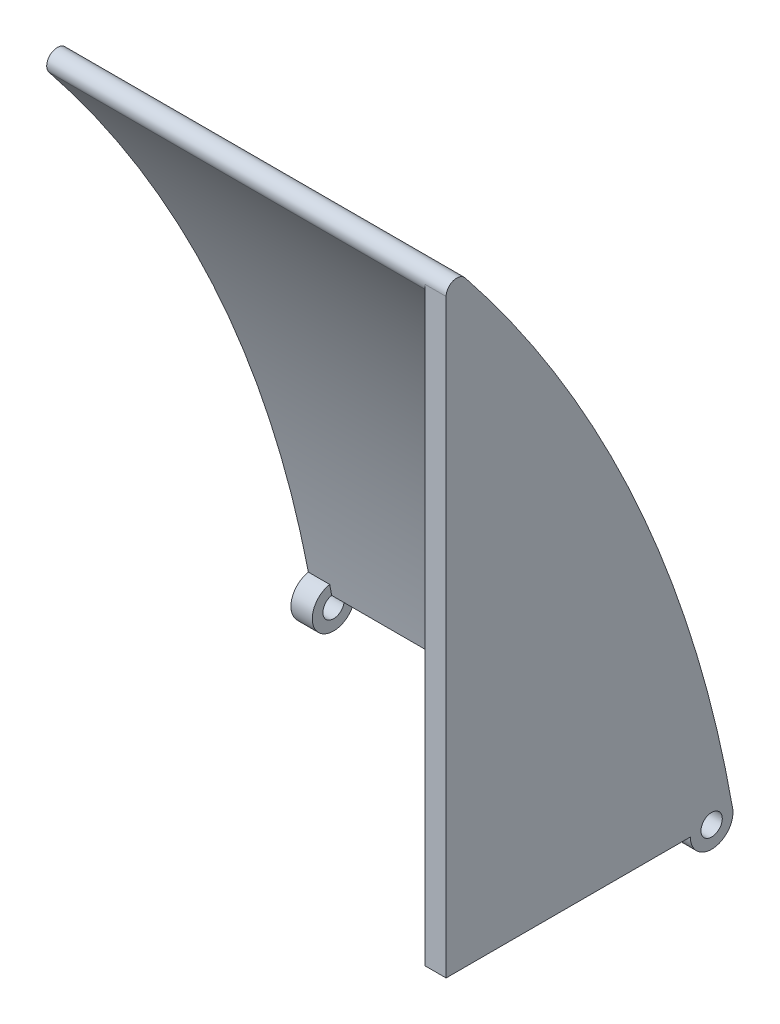
ISO-10303-21;
HEADER;
FILE_DESCRIPTION(('STEP AP214'),'2;1');
FILE_NAME('part.step','',(''),(''),'','','');
FILE_SCHEMA(('AUTOMOTIVE_DESIGN { 1 0 10303 214 1 1 1 1 }'));
ENDSEC;
DATA;
#1=APPLICATION_CONTEXT('core data for automotive mechanical design processes');
#2=APPLICATION_PROTOCOL_DEFINITION('international standard','automotive_design',2000,#1);
#3=PRODUCT_CONTEXT('',#1,'mechanical');
#4=PRODUCT('Part','Part','',(#3));
#5=PRODUCT_RELATED_PRODUCT_CATEGORY('part','',(#4));
#6=PRODUCT_DEFINITION_FORMATION('','',#4);
#7=PRODUCT_DEFINITION_CONTEXT('part definition',#1,'design');
#8=PRODUCT_DEFINITION('design','',#6,#7);
#9=PRODUCT_DEFINITION_SHAPE('','',#8);
#10=(LENGTH_UNIT() NAMED_UNIT(*) SI_UNIT(.MILLI.,.METRE.));
#11=(NAMED_UNIT(*) PLANE_ANGLE_UNIT() SI_UNIT($,.RADIAN.));
#12=(NAMED_UNIT(*) SI_UNIT($,.STERADIAN.) SOLID_ANGLE_UNIT());
#13=UNCERTAINTY_MEASURE_WITH_UNIT(LENGTH_MEASURE(1.E-05),#10,'distance_accuracy_value','');
#14=(GEOMETRIC_REPRESENTATION_CONTEXT(3) GLOBAL_UNCERTAINTY_ASSIGNED_CONTEXT((#13)) GLOBAL_UNIT_ASSIGNED_CONTEXT((#10,
#11,#12)) REPRESENTATION_CONTEXT('',''));
#15=CARTESIAN_POINT('',(0.,0.,0.));
#16=DIRECTION('',(0.,0.,1.));
#17=DIRECTION('',(1.,0.,0.));
#18=AXIS2_PLACEMENT_3D('',#15,#16,#17);
#19=CARTESIAN_POINT('',(46.84,-52.6701912273033,304.466268426335));
#20=DIRECTION('',(-1.,0.,0.));
#21=DIRECTION('',(0.,0.,1.));
#22=AXIS2_PLACEMENT_3D('',#19,#20,#21);
#23=CYLINDRICAL_SURFACE('',#22,303.986824400941);
#24=CARTESIAN_POINT('',(41.84,-52.6701912273033,304.466268426335));
#25=DIRECTION('',(1.,0.,0.));
#26=DIRECTION('',(0.,0.,-1.));
#27=AXIS2_PLACEMENT_3D('',#24,#25,#26);
#28=CIRCLE('',#27,303.986824400941);
#29=CARTESIAN_POINT('',(41.84,136.882226425013,66.8155365285973));
#30=VERTEX_POINT('',#29);
#31=CARTESIAN_POINT('',(41.84,2.46038215953579,5.52043840456218));
#32=VERTEX_POINT('',#31);
#33=EDGE_CURVE('E121',#30,#32,#28,.F.);
#34=ORIENTED_EDGE('',*,*,#33,.F.);
#35=DIRECTION('',(-1.,0.,0.));
#36=VECTOR('',#35,1.);
#37=CARTESIAN_POINT('',(46.84,136.882226425013,66.8155365285973));
#38=LINE('',#37,#36);
#39=CARTESIAN_POINT('',(-46.84,136.882226425013,66.8155365285973));
#40=VERTEX_POINT('',#39);
#41=EDGE_CURVE('E124',#30,#40,#38,.T.);
#42=ORIENTED_EDGE('',*,*,#41,.T.);
#43=CARTESIAN_POINT('',(-46.84,-52.6701912273033,304.466268426335));
#44=DIRECTION('',(-1.,0.,0.));
#45=DIRECTION('',(0.,0.,-1.));
#46=AXIS2_PLACEMENT_3D('',#43,#44,#45);
#47=CIRCLE('',#46,303.986824400941);
#48=CARTESIAN_POINT('',(-46.84,4.91708107240964,5.98394821549386));
#49=VERTEX_POINT('',#48);
#50=EDGE_CURVE('E156',#40,#49,#47,.T.);
#51=ORIENTED_EDGE('',*,*,#50,.T.);
#52=DIRECTION('',(-1.,0.,0.));
#53=VECTOR('',#52,1.);
#54=CARTESIAN_POINT('',(-44.34,4.91708107240862,5.98394821549367));
#55=LINE('',#54,#53);
#56=CARTESIAN_POINT('',(-41.84,4.91708107240861,5.98394821549372));
#57=VERTEX_POINT('',#56);
#58=EDGE_CURVE('E171',#57,#49,#55,.T.);
#59=ORIENTED_EDGE('',*,*,#58,.F.);
#60=CARTESIAN_POINT('',(-41.84,-52.6701912273033,304.466268426335));
#61=DIRECTION('',(-1.,0.,0.));
#62=DIRECTION('',(0.,0.,1.));
#63=AXIS2_PLACEMENT_3D('',#60,#61,#62);
#64=CIRCLE('',#63,303.986824400941);
#65=CARTESIAN_POINT('',(-41.84,2.460382159541,5.52043840456312));
#66=VERTEX_POINT('',#65);
#67=EDGE_CURVE('E41',#66,#57,#64,.F.);
#68=ORIENTED_EDGE('',*,*,#67,.F.);
#69=DIRECTION('',(1.,0.,0.));
#70=VECTOR('',#69,1.);
#71=CARTESIAN_POINT('',(0.,2.46038215953579,5.52043840456218));
#72=LINE('',#71,#70);
#73=EDGE_CURVE('E56',#66,#32,#72,.T.);
#74=ORIENTED_EDGE('',*,*,#73,.T.);
#75=EDGE_LOOP('',(#34,#42,#51,#59,#68,#74));
#76=FACE_BOUND('',#75,.T.);
#77=ADVANCED_FACE('F33',(#76),#23,.F.);
#78=CARTESIAN_POINT('',(46.84,138.441113212506,64.8610872497012));
#79=DIRECTION('',(-1.,0.,0.));
#80=DIRECTION('',(0.,0.,1.));
#81=AXIS2_PLACEMENT_3D('',#78,#79,#80);
#82=CYLINDRICAL_SURFACE('',#81,2.5);
#83=DIRECTION('',(1.,0.,0.));
#84=VECTOR('',#83,1.);
#85=CARTESIAN_POINT('',(41.84,138.441113212506,67.3610872497012));
#86=LINE('',#85,#84);
#87=CARTESIAN_POINT('',(41.84,138.441113212506,67.3610872497012));
#88=VERTEX_POINT('',#87);
#89=CARTESIAN_POINT('',(46.84,138.441113212506,67.3610872497012));
#90=VERTEX_POINT('',#89);
#91=EDGE_CURVE('E233',#88,#90,#86,.T.);
#92=ORIENTED_EDGE('',*,*,#91,.T.);
#93=CARTESIAN_POINT('',(46.84,138.441113212506,64.8610872497012));
#94=DIRECTION('',(1.,0.,0.));
#95=DIRECTION('',(0.,0.,1.));
#96=AXIS2_PLACEMENT_3D('',#93,#94,#95);
#97=CIRCLE('',#96,2.5);
#98=CARTESIAN_POINT('',(46.84,140.,62.9066379708051));
#99=VERTEX_POINT('',#98);
#100=EDGE_CURVE('E148',#99,#90,#97,.T.);
#101=ORIENTED_EDGE('',*,*,#100,.F.);
#102=DIRECTION('',(-1.,0.,0.));
#103=VECTOR('',#102,1.);
#104=CARTESIAN_POINT('',(46.84,140.,62.9066379708051));
#105=LINE('',#104,#103);
#106=CARTESIAN_POINT('',(-46.84,140.,62.9066379708051));
#107=VERTEX_POINT('',#106);
#108=EDGE_CURVE('E147',#99,#107,#105,.T.);
#109=ORIENTED_EDGE('',*,*,#108,.T.);
#110=CARTESIAN_POINT('',(-46.84,138.441113212506,64.8610872497012));
#111=DIRECTION('',(1.,0.,0.));
#112=DIRECTION('',(0.,0.,1.));
#113=AXIS2_PLACEMENT_3D('',#110,#111,#112);
#114=CIRCLE('',#113,2.5);
#115=EDGE_CURVE('E145',#107,#40,#114,.T.);
#116=ORIENTED_EDGE('',*,*,#115,.T.);
#117=ORIENTED_EDGE('',*,*,#41,.F.);
#118=CARTESIAN_POINT('',(41.84,138.441113212506,64.8610872497012));
#119=DIRECTION('',(-1.,0.,0.));
#120=DIRECTION('',(0.,0.,-1.));
#121=AXIS2_PLACEMENT_3D('',#118,#119,#120);
#122=CIRCLE('',#121,2.5);
#123=EDGE_CURVE('E134',#30,#88,#122,.T.);
#124=ORIENTED_EDGE('',*,*,#123,.T.);
#125=EDGE_LOOP('',(#92,#101,#109,#116,#117,#124));
#126=FACE_BOUND('',#125,.T.);
#127=ADVANCED_FACE('F142',(#126),#82,.T.);
#128=CARTESIAN_POINT('',(46.84,0.,0.));
#129=DIRECTION('',(0.,1.,3.27142010796196E-13));
#130=DIRECTION('',(0.,-3.27142010796196E-13,1.));
#131=AXIS2_PLACEMENT_3D('',#128,#129,#130);
#132=PLANE('',#131);
#133=DIRECTION('',(0.,3.27142010796196E-13,-1.));
#134=VECTOR('',#133,1.);
#135=CARTESIAN_POINT('',(41.84,0.,0.));
#136=LINE('',#135,#134);
#137=CARTESIAN_POINT('',(41.84,-8.43088491148678E-13,2.57713305942203));
#138=VERTEX_POINT('',#137);
#139=CARTESIAN_POINT('',(41.84,0.,0.0771330594283685));
#140=VERTEX_POINT('',#139);
#141=EDGE_CURVE('E129',#138,#140,#136,.T.);
#142=ORIENTED_EDGE('',*,*,#141,.F.);
#143=DIRECTION('',(1.,0.,0.));
#144=VECTOR('',#143,1.);
#145=CARTESIAN_POINT('',(-46.84,-8.43088491148678E-13,2.57713305942203));
#146=LINE('',#145,#144);
#147=CARTESIAN_POINT('',(-41.84,-8.43088491148678E-13,2.57713305942203));
#148=VERTEX_POINT('',#147);
#149=EDGE_CURVE('E223',#138,#148,#146,.F.);
#150=ORIENTED_EDGE('',*,*,#149,.T.);
#151=DIRECTION('',(0.,-3.27142010796196E-13,1.));
#152=VECTOR('',#151,1.);
#153=CARTESIAN_POINT('',(-41.84,0.,0.));
#154=LINE('',#153,#152);
#155=CARTESIAN_POINT('',(-41.84,0.,0.0771330594283685));
#156=VERTEX_POINT('',#155);
#157=EDGE_CURVE('E187',#156,#148,#154,.T.);
#158=ORIENTED_EDGE('',*,*,#157,.F.);
#159=DIRECTION('',(-1.,0.,0.));
#160=VECTOR('',#159,1.);
#161=CARTESIAN_POINT('',(-41.84,0.,0.0771330594283685));
#162=LINE('',#161,#160);
#163=CARTESIAN_POINT('',(-46.84,0.,0.0771330594283685));
#164=VERTEX_POINT('',#163);
#165=EDGE_CURVE('E175',#164,#156,#162,.F.);
#166=ORIENTED_EDGE('',*,*,#165,.F.);
#167=DIRECTION('',(0.,3.27142010796196E-13,-1.));
#168=VECTOR('',#167,1.);
#169=CARTESIAN_POINT('',(-46.84,0.,0.));
#170=LINE('',#169,#168);
#171=CARTESIAN_POINT('',(-46.84,0.,0.));
#172=VERTEX_POINT('',#171);
#173=EDGE_CURVE('E197',#164,#172,#170,.T.);
#174=ORIENTED_EDGE('',*,*,#173,.T.);
#175=DIRECTION('',(-1.,0.,0.));
#176=VECTOR('',#175,1.);
#177=CARTESIAN_POINT('',(46.84,0.,0.));
#178=LINE('',#177,#176);
#179=CARTESIAN_POINT('',(46.84,0.,0.));
#180=VERTEX_POINT('',#179);
#181=EDGE_CURVE('E161',#180,#172,#178,.T.);
#182=ORIENTED_EDGE('',*,*,#181,.F.);
#183=DIRECTION('',(0.,3.27142010796196E-13,-1.));
#184=VECTOR('',#183,1.);
#185=CARTESIAN_POINT('',(46.84,0.,0.));
#186=LINE('',#185,#184);
#187=CARTESIAN_POINT('',(46.84,0.,0.0771330594283685));
#188=VERTEX_POINT('',#187);
#189=EDGE_CURVE('E198',#188,#180,#186,.T.);
#190=ORIENTED_EDGE('',*,*,#189,.F.);
#191=DIRECTION('',(1.,0.,0.));
#192=VECTOR('',#191,1.);
#193=CARTESIAN_POINT('',(41.84,0.,0.0771330594283685));
#194=LINE('',#193,#192);
#195=EDGE_CURVE('E130',#188,#140,#194,.F.);
#196=ORIENTED_EDGE('',*,*,#195,.T.);
#197=EDGE_LOOP('',(#142,#150,#158,#166,#174,#182,#190,#196));
#198=FACE_BOUND('',#197,.T.);
#199=ADVANCED_FACE('F35',(#198),#132,.F.);
#200=CARTESIAN_POINT('',(46.84,0.,0.));
#201=DIRECTION('',(0.,-0.173648177666931,0.984807753012208));
#202=DIRECTION('',(0.,-0.984807753012208,-0.173648177666931));
#203=AXIS2_PLACEMENT_3D('',#200,#201,#202);
#204=PLANE('',#203);
#205=DIRECTION('',(-1.,0.,0.));
#206=VECTOR('',#205,1.);
#207=CARTESIAN_POINT('',(46.84,0.984807753012208,0.173648177666931));
#208=LINE('',#207,#206);
#209=CARTESIAN_POINT('',(46.84,0.984807753012208,0.173648177666931));
#210=VERTEX_POINT('',#209);
#211=CARTESIAN_POINT('',(-46.84,0.984807753012208,0.173648177666931));
#212=VERTEX_POINT('',#211);
#213=EDGE_CURVE('E150',#210,#212,#208,.T.);
#214=ORIENTED_EDGE('',*,*,#213,.F.);
#215=DIRECTION('',(0.,0.984807753012208,0.173648177666931));
#216=VECTOR('',#215,1.);
#217=CARTESIAN_POINT('',(46.84,0.,0.));
#218=LINE('',#217,#216);
#219=EDGE_CURVE('E200',#180,#210,#218,.T.);
#220=ORIENTED_EDGE('',*,*,#219,.F.);
#221=ORIENTED_EDGE('',*,*,#181,.T.);
#222=DIRECTION('',(0.,0.984807753012208,0.173648177666931));
#223=VECTOR('',#222,1.);
#224=CARTESIAN_POINT('',(-46.84,0.,0.));
#225=LINE('',#224,#223);
#226=EDGE_CURVE('E204',#172,#212,#225,.T.);
#227=ORIENTED_EDGE('',*,*,#226,.T.);
#228=EDGE_LOOP('',(#214,#220,#221,#227));
#229=FACE_BOUND('',#228,.T.);
#230=ADVANCED_FACE('F257',(#229),#204,.F.);
#231=CARTESIAN_POINT('',(46.84,-52.6701912273033,304.466268426335));
#232=DIRECTION('',(-1.,0.,0.));
#233=DIRECTION('',(0.,0.,1.));
#234=AXIS2_PLACEMENT_3D('',#231,#232,#233);
#235=CYLINDRICAL_SURFACE('',#234,308.986824400941);
#236=CARTESIAN_POINT('',(-46.84,-52.6701912273033,304.466268426335));
#237=DIRECTION('',(1.,0.,0.));
#238=DIRECTION('',(0.,0.,-1.));
#239=AXIS2_PLACEMENT_3D('',#236,#237,#238);
#240=CIRCLE('',#239,308.986824400941);
#241=EDGE_CURVE('E206',#212,#107,#240,.T.);
#242=ORIENTED_EDGE('',*,*,#241,.T.);
#243=ORIENTED_EDGE('',*,*,#108,.F.);
#244=CARTESIAN_POINT('',(46.84,-52.6701912273033,304.466268426335));
#245=DIRECTION('',(1.,0.,0.));
#246=DIRECTION('',(0.,0.,-1.));
#247=AXIS2_PLACEMENT_3D('',#244,#245,#246);
#248=CIRCLE('',#247,308.986824400941);
#249=EDGE_CURVE('E153',#210,#99,#248,.T.);
#250=ORIENTED_EDGE('',*,*,#249,.F.);
#251=ORIENTED_EDGE('',*,*,#213,.T.);
#252=EDGE_LOOP('',(#242,#243,#250,#251));
#253=FACE_BOUND('',#252,.T.);
#254=ADVANCED_FACE('F210',(#253),#235,.T.);
#255=CARTESIAN_POINT('',(46.84,-52.6701912273033,304.466268426335));
#256=DIRECTION('',(1.,0.,0.));
#257=DIRECTION('',(0.,0.,-1.));
#258=AXIS2_PLACEMENT_3D('',#255,#256,#257);
#259=PLANE('',#258);
#260=ORIENTED_EDGE('',*,*,#100,.T.);
#261=DIRECTION('',(0.,-1.,0.));
#262=VECTOR('',#261,1.);
#263=CARTESIAN_POINT('',(46.84,0.,67.3610872497017));
#264=LINE('',#263,#262);
#265=CARTESIAN_POINT('',(46.84,0.,67.3610872497017));
#266=VERTEX_POINT('',#265);
#267=EDGE_CURVE('E240',#90,#266,#264,.T.);
#268=ORIENTED_EDGE('',*,*,#267,.T.);
#269=DIRECTION('',(0.,0.,-1.));
#270=VECTOR('',#269,1.);
#271=CARTESIAN_POINT('',(46.84,0.,10.0771330594157));
#272=LINE('',#271,#270);
#273=CARTESIAN_POINT('',(46.84,0.,10.0771330594157));
#274=VERTEX_POINT('',#273);
#275=EDGE_CURVE('E48',#266,#274,#272,.T.);
#276=ORIENTED_EDGE('',*,*,#275,.T.);
#277=CARTESIAN_POINT('',(46.84,-1.66094351813917E-12,5.07713305942203));
#278=DIRECTION('',(1.,0.,0.));
#279=DIRECTION('',(0.,0.,-1.));
#280=AXIS2_PLACEMENT_3D('',#277,#278,#279);
#281=CIRCLE('',#280,4.99999999999367);
#282=EDGE_CURVE('E189',#274,#188,#281,.T.);
#283=ORIENTED_EDGE('',*,*,#282,.T.);
#284=ORIENTED_EDGE('',*,*,#189,.T.);
#285=ORIENTED_EDGE('',*,*,#219,.T.);
#286=ORIENTED_EDGE('',*,*,#249,.T.);
#287=EDGE_LOOP('',(#260,#268,#276,#283,#284,#285,#286));
#288=FACE_BOUND('',#287,.T.);
#289=CARTESIAN_POINT('',(46.84,-1.66094351813917E-12,5.07713305942203));
#290=DIRECTION('',(1.,0.,0.));
#291=DIRECTION('',(0.,0.,-1.));
#292=AXIS2_PLACEMENT_3D('',#289,#290,#291);
#293=CIRCLE('',#292,2.5);
#294=CARTESIAN_POINT('',(46.84,-1.66094351813917E-12,2.57713305942203));
#295=VERTEX_POINT('',#294);
#296=EDGE_CURVE('E227',#295,#295,#293,.T.);
#297=ORIENTED_EDGE('',*,*,#296,.F.);
#298=EDGE_LOOP('',(#297));
#299=FACE_BOUND('',#298,.T.);
#300=ADVANCED_FACE('F253',(#288,#299),#259,.T.);
#301=CARTESIAN_POINT('',(-46.84,-52.6701912273033,304.466268426335));
#302=DIRECTION('',(1.,0.,0.));
#303=DIRECTION('',(0.,0.,-1.));
#304=AXIS2_PLACEMENT_3D('',#301,#302,#303);
#305=PLANE('',#304);
#306=CARTESIAN_POINT('',(-46.84,-1.66094351813917E-12,5.07713305942203));
#307=DIRECTION('',(1.,0.,0.));
#308=DIRECTION('',(0.,0.,-1.));
#309=AXIS2_PLACEMENT_3D('',#306,#307,#308);
#310=CIRCLE('',#309,2.5);
#311=CARTESIAN_POINT('',(-46.84,-1.66094351813917E-12,2.57713305942203));
#312=VERTEX_POINT('',#311);
#313=EDGE_CURVE('E224',#312,#312,#310,.T.);
#314=ORIENTED_EDGE('',*,*,#313,.T.);
#315=EDGE_LOOP('',(#314));
#316=FACE_BOUND('',#315,.T.);
#317=ORIENTED_EDGE('',*,*,#173,.F.);
#318=CARTESIAN_POINT('',(-46.84,-1.66094351813917E-12,5.07713305942203));
#319=DIRECTION('',(1.,0.,0.));
#320=DIRECTION('',(0.,0.,-1.));
#321=AXIS2_PLACEMENT_3D('',#318,#319,#320);
#322=CIRCLE('',#321,4.99999999999367);
#323=EDGE_CURVE('E179',#49,#164,#322,.T.);
#324=ORIENTED_EDGE('',*,*,#323,.F.);
#325=ORIENTED_EDGE('',*,*,#50,.F.);
#326=ORIENTED_EDGE('',*,*,#115,.F.);
#327=ORIENTED_EDGE('',*,*,#241,.F.);
#328=ORIENTED_EDGE('',*,*,#226,.F.);
#329=EDGE_LOOP('',(#317,#324,#325,#326,#327,#328));
#330=FACE_BOUND('',#329,.T.);
#331=ADVANCED_FACE('F217',(#316,#330),#305,.F.);
#332=CARTESIAN_POINT('',(41.84,-1.66094351813917E-12,5.07713305942203));
#333=DIRECTION('',(1.,0.,0.));
#334=DIRECTION('',(0.,0.,-1.));
#335=AXIS2_PLACEMENT_3D('',#332,#333,#334);
#336=PLANE('',#335);
#337=ORIENTED_EDGE('',*,*,#33,.T.);
#338=CARTESIAN_POINT('',(41.84,-1.66094351813917E-12,5.07713305942203));
#339=DIRECTION('',(1.,0.,0.));
#340=DIRECTION('',(0.,0.,-1.));
#341=AXIS2_PLACEMENT_3D('',#338,#339,#340);
#342=CIRCLE('',#341,2.5);
#343=EDGE_CURVE('E181',#32,#138,#342,.T.);
#344=ORIENTED_EDGE('',*,*,#343,.T.);
#345=ORIENTED_EDGE('',*,*,#141,.T.);
#346=CARTESIAN_POINT('',(41.84,-1.66094351813917E-12,5.07713305942203));
#347=DIRECTION('',(1.,0.,0.));
#348=DIRECTION('',(0.,0.,-1.));
#349=AXIS2_PLACEMENT_3D('',#346,#347,#348);
#350=CIRCLE('',#349,4.99999999999367);
#351=CARTESIAN_POINT('',(41.84,0.,10.0771330594157));
#352=VERTEX_POINT('',#351);
#353=EDGE_CURVE('E190',#352,#140,#350,.T.);
#354=ORIENTED_EDGE('',*,*,#353,.F.);
#355=DIRECTION('',(0.,0.,-1.));
#356=VECTOR('',#355,1.);
#357=CARTESIAN_POINT('',(41.84,0.,10.0771330594157));
#358=LINE('',#357,#356);
#359=CARTESIAN_POINT('',(41.84,0.,67.3610872497017));
#360=VERTEX_POINT('',#359);
#361=EDGE_CURVE('E236',#360,#352,#358,.T.);
#362=ORIENTED_EDGE('',*,*,#361,.F.);
#363=DIRECTION('',(0.,-1.,0.));
#364=VECTOR('',#363,1.);
#365=CARTESIAN_POINT('',(41.84,0.,67.3610872497017));
#366=LINE('',#365,#364);
#367=EDGE_CURVE('E138',#88,#360,#366,.T.);
#368=ORIENTED_EDGE('',*,*,#367,.F.);
#369=ORIENTED_EDGE('',*,*,#123,.F.);
#370=EDGE_LOOP('',(#337,#344,#345,#354,#362,#368,#369));
#371=FACE_BOUND('',#370,.T.);
#372=ADVANCED_FACE('F135',(#371),#336,.F.);
#373=CARTESIAN_POINT('',(41.84,-1.66094351813917E-12,5.07713305942203));
#374=DIRECTION('',(1.,0.,0.));
#375=DIRECTION('',(0.,0.,-1.));
#376=AXIS2_PLACEMENT_3D('',#373,#374,#375);
#377=CYLINDRICAL_SURFACE('',#376,4.99999999999367);
#378=DIRECTION('',(1.,0.,0.));
#379=VECTOR('',#378,1.);
#380=CARTESIAN_POINT('',(41.84,0.,10.0771330594157));
#381=LINE('',#380,#379);
#382=EDGE_CURVE('E230',#352,#274,#381,.T.);
#383=ORIENTED_EDGE('',*,*,#382,.F.);
#384=ORIENTED_EDGE('',*,*,#353,.T.);
#385=ORIENTED_EDGE('',*,*,#195,.F.);
#386=ORIENTED_EDGE('',*,*,#282,.F.);
#387=EDGE_LOOP('',(#383,#384,#385,#386));
#388=FACE_BOUND('',#387,.T.);
#389=ADVANCED_FACE('F251',(#388),#377,.T.);
#390=CARTESIAN_POINT('',(-41.84,-1.66094351813917E-12,5.07713305942203));
#391=DIRECTION('',(-1.,0.,0.));
#392=DIRECTION('',(0.,0.,-1.));
#393=AXIS2_PLACEMENT_3D('',#390,#391,#392);
#394=PLANE('',#393);
#395=ORIENTED_EDGE('',*,*,#157,.T.);
#396=CARTESIAN_POINT('',(-41.84,-1.66094351813917E-12,5.07713305942203));
#397=DIRECTION('',(-1.,0.,0.));
#398=DIRECTION('',(0.,0.,1.));
#399=AXIS2_PLACEMENT_3D('',#396,#397,#398);
#400=CIRCLE('',#399,2.5);
#401=EDGE_CURVE('E11',#148,#66,#400,.T.);
#402=ORIENTED_EDGE('',*,*,#401,.T.);
#403=ORIENTED_EDGE('',*,*,#67,.T.);
#404=CARTESIAN_POINT('',(-41.84,-1.66094351813917E-12,5.07713305942203));
#405=DIRECTION('',(1.,0.,0.));
#406=DIRECTION('',(0.,0.,-1.));
#407=AXIS2_PLACEMENT_3D('',#404,#405,#406);
#408=CIRCLE('',#407,4.99999999999367);
#409=EDGE_CURVE('E169',#57,#156,#408,.T.);
#410=ORIENTED_EDGE('',*,*,#409,.T.);
#411=EDGE_LOOP('',(#395,#402,#403,#410));
#412=FACE_BOUND('',#411,.T.);
#413=ADVANCED_FACE('F167',(#412),#394,.F.);
#414=CARTESIAN_POINT('',(-41.84,-1.66094351813917E-12,5.07713305942203));
#415=DIRECTION('',(-1.,0.,0.));
#416=DIRECTION('',(0.,0.,1.));
#417=AXIS2_PLACEMENT_3D('',#414,#415,#416);
#418=CYLINDRICAL_SURFACE('',#417,4.99999999999367);
#419=ORIENTED_EDGE('',*,*,#323,.T.);
#420=ORIENTED_EDGE('',*,*,#165,.T.);
#421=ORIENTED_EDGE('',*,*,#409,.F.);
#422=ORIENTED_EDGE('',*,*,#58,.T.);
#423=EDGE_LOOP('',(#419,#420,#421,#422));
#424=FACE_BOUND('',#423,.T.);
#425=ADVANCED_FACE('F178',(#424),#418,.T.);
#426=CARTESIAN_POINT('',(-46.84,-1.66094351813917E-12,5.07713305942203));
#427=DIRECTION('',(1.,0.,0.));
#428=DIRECTION('',(0.,0.,-1.));
#429=AXIS2_PLACEMENT_3D('',#426,#427,#428);
#430=CYLINDRICAL_SURFACE('',#429,2.5);
#431=ORIENTED_EDGE('',*,*,#313,.F.);
#432=EDGE_LOOP('',(#431));
#433=FACE_BOUND('',#432,.T.);
#434=ORIENTED_EDGE('',*,*,#296,.T.);
#435=EDGE_LOOP('',(#434));
#436=FACE_BOUND('',#435,.T.);
#437=ORIENTED_EDGE('',*,*,#73,.F.);
#438=ORIENTED_EDGE('',*,*,#401,.F.);
#439=ORIENTED_EDGE('',*,*,#149,.F.);
#440=ORIENTED_EDGE('',*,*,#343,.F.);
#441=EDGE_LOOP('',(#437,#438,#439,#440));
#442=FACE_BOUND('',#441,.T.);
#443=ADVANCED_FACE('F282',(#433,#436,#442),#430,.F.);
#444=CARTESIAN_POINT('',(41.84,0.,10.0771330594157));
#445=DIRECTION('',(0.,-1.,0.));
#446=DIRECTION('',(0.,0.,-1.));
#447=AXIS2_PLACEMENT_3D('',#444,#445,#446);
#448=PLANE('',#447);
#449=ORIENTED_EDGE('',*,*,#275,.F.);
#450=DIRECTION('',(1.,0.,0.));
#451=VECTOR('',#450,1.);
#452=CARTESIAN_POINT('',(41.84,0.,67.3610872497017));
#453=LINE('',#452,#451);
#454=EDGE_CURVE('E235',#360,#266,#453,.T.);
#455=ORIENTED_EDGE('',*,*,#454,.F.);
#456=ORIENTED_EDGE('',*,*,#361,.T.);
#457=ORIENTED_EDGE('',*,*,#382,.T.);
#458=EDGE_LOOP('',(#449,#455,#456,#457));
#459=FACE_BOUND('',#458,.T.);
#460=ADVANCED_FACE('F248',(#459),#448,.T.);
#461=CARTESIAN_POINT('',(41.84,0.,67.3610872497017));
#462=DIRECTION('',(0.,0.,1.));
#463=DIRECTION('',(0.,-1.,0.));
#464=AXIS2_PLACEMENT_3D('',#461,#462,#463);
#465=PLANE('',#464);
#466=ORIENTED_EDGE('',*,*,#267,.F.);
#467=ORIENTED_EDGE('',*,*,#91,.F.);
#468=ORIENTED_EDGE('',*,*,#367,.T.);
#469=ORIENTED_EDGE('',*,*,#454,.T.);
#470=EDGE_LOOP('',(#466,#467,#468,#469));
#471=FACE_BOUND('',#470,.T.);
#472=ADVANCED_FACE('F244',(#471),#465,.T.);
#473=CLOSED_SHELL('',(#77,#127,#199,#230,#254,#300,#331,#372,#389,#413,#425,#443,#460,#472));
#474=MANIFOLD_SOLID_BREP('B2',#473);
#475=ADVANCED_BREP_SHAPE_REPRESENTATION('',(#18,#474),#14);
#476=SHAPE_DEFINITION_REPRESENTATION(#9,#475);
ENDSEC;
END-ISO-10303-21;
